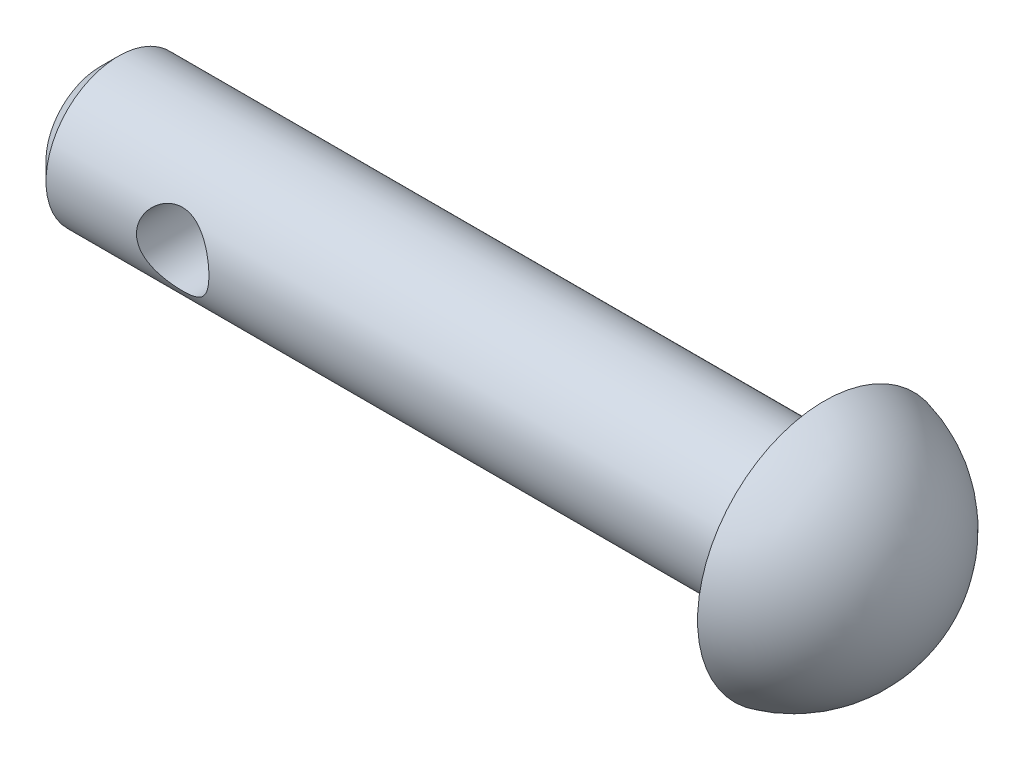
ISO-10303-21;
HEADER;
FILE_DESCRIPTION(('STEP AP214'),'2;1');
FILE_NAME('part.step','',(''),(''),'','','');
FILE_SCHEMA(('AUTOMOTIVE_DESIGN { 1 0 10303 214 1 1 1 1 }'));
ENDSEC;
DATA;
#1=APPLICATION_CONTEXT('core data for automotive mechanical design processes');
#2=APPLICATION_PROTOCOL_DEFINITION('international standard','automotive_design',2000,#1);
#3=PRODUCT_CONTEXT('',#1,'mechanical');
#4=PRODUCT('Part','Part','',(#3));
#5=PRODUCT_RELATED_PRODUCT_CATEGORY('part','',(#4));
#6=PRODUCT_DEFINITION_FORMATION('','',#4);
#7=PRODUCT_DEFINITION_CONTEXT('part definition',#1,'design');
#8=PRODUCT_DEFINITION('design','',#6,#7);
#9=PRODUCT_DEFINITION_SHAPE('','',#8);
#10=(LENGTH_UNIT() NAMED_UNIT(*) SI_UNIT(.MILLI.,.METRE.));
#11=(NAMED_UNIT(*) PLANE_ANGLE_UNIT() SI_UNIT($,.RADIAN.));
#12=(NAMED_UNIT(*) SI_UNIT($,.STERADIAN.) SOLID_ANGLE_UNIT());
#13=UNCERTAINTY_MEASURE_WITH_UNIT(LENGTH_MEASURE(1.E-05),#10,'distance_accuracy_value','');
#14=(GEOMETRIC_REPRESENTATION_CONTEXT(3) GLOBAL_UNCERTAINTY_ASSIGNED_CONTEXT((#13)) GLOBAL_UNIT_ASSIGNED_CONTEXT((#10,
#11,#12)) REPRESENTATION_CONTEXT('',''));
#15=CARTESIAN_POINT('',(0.,0.,0.));
#16=DIRECTION('',(0.,0.,1.));
#17=DIRECTION('',(1.,0.,0.));
#18=AXIS2_PLACEMENT_3D('',#15,#16,#17);
#19=CARTESIAN_POINT('',(-20.,0.,0.));
#20=DIRECTION('',(1.,0.,0.));
#21=DIRECTION('',(0.,0.,-1.));
#22=AXIS2_PLACEMENT_3D('',#19,#20,#21);
#23=CYLINDRICAL_SURFACE('',#22,2.);
#24=CARTESIAN_POINT('',(-19.5,0.,0.));
#25=DIRECTION('',(1.,0.,0.));
#26=DIRECTION('',(0.,0.,-1.));
#27=AXIS2_PLACEMENT_3D('',#24,#25,#26);
#28=CIRCLE('',#27,2.);
#29=CARTESIAN_POINT('',(-19.5,0.,-2.));
#30=VERTEX_POINT('',#29);
#31=EDGE_CURVE('E45',#30,#30,#28,.T.);
#32=ORIENTED_EDGE('',*,*,#31,.T.);
#33=EDGE_LOOP('',(#32));
#34=FACE_BOUND('',#33,.T.);
#35=CARTESIAN_POINT('',(-15.,0.,-2.));
#36=CARTESIAN_POINT('',(-15.0000033023195,-0.0525719629529865,-1.99999713404151));
#37=CARTESIAN_POINT('',(-15.0041700731217,-0.105206599698033,-1.99790491019518));
#38=CARTESIAN_POINT('',(-15.0206528803409,-0.208920235268425,-1.98974156037396));
#39=CARTESIAN_POINT('',(-15.0329843929976,-0.259996086713504,-1.98366287828984));
#40=CARTESIAN_POINT('',(-15.0651938086168,-0.358933544880575,-1.96816279403312));
#41=CARTESIAN_POINT('',(-15.085042384248,-0.406806802939181,-1.9587543917752));
#42=CARTESIAN_POINT('',(-15.1315706213649,-0.498472616806566,-1.93745776515779));
#43=CARTESIAN_POINT('',(-15.1582497442489,-0.54226549399005,-1.9255697363353));
#44=CARTESIAN_POINT('',(-15.2195172494853,-0.62750781776192,-1.89956258258057));
#45=CARTESIAN_POINT('',(-15.2544864792396,-0.668655211122113,-1.88535199127536));
#46=CARTESIAN_POINT('',(-15.330521479247,-0.744779444866978,-1.85659970246744));
#47=CARTESIAN_POINT('',(-15.3715918517724,-0.779751583106767,-1.84205776209035));
#48=CARTESIAN_POINT('',(-15.4624833495234,-0.84525200045028,-1.81298951197347));
#49=CARTESIAN_POINT('',(-15.5127360983459,-0.875225335551638,-1.79855186970132));
#50=CARTESIAN_POINT('',(-15.6183673359862,-0.926168226890696,-1.77285978772321));
#51=CARTESIAN_POINT('',(-15.6737421287227,-0.947144214966335,-1.7616030760699));
#52=CARTESIAN_POINT('',(-15.7846651054219,-0.97813244218859,-1.74457867037808));
#53=CARTESIAN_POINT('',(-15.8400044520674,-0.988725857080443,-1.73852271583713));
#54=CARTESIAN_POINT('',(-15.9519788377795,-1.00042699330885,-1.73181889948528));
#55=CARTESIAN_POINT('',(-16.0086125408712,-1.00154408837308,-1.73116569343288));
#56=CARTESIAN_POINT('',(-16.1142860243154,-0.994687287172296,-1.73510930257248));
#57=CARTESIAN_POINT('',(-16.163424031223,-0.987784559536823,-1.73908763662013));
#58=CARTESIAN_POINT('',(-16.259721909373,-0.966939849056935,-1.7507622873385));
#59=CARTESIAN_POINT('',(-16.3068811453053,-0.952995623897654,-1.75845978831776));
#60=CARTESIAN_POINT('',(-16.3992291325657,-0.918209780386006,-1.77687476412741));
#61=CARTESIAN_POINT('',(-16.4443463987858,-0.897215067115997,-1.78765840663998));
#62=CARTESIAN_POINT('',(-16.53063429259,-0.849041687668004,-1.81103404281404));
#63=CARTESIAN_POINT('',(-16.5718031356001,-0.821860243812469,-1.8236268478019));
#64=CARTESIAN_POINT('',(-16.6545212527432,-0.75806605491279,-1.85113157903286));
#65=CARTESIAN_POINT('',(-16.6954568735762,-0.720694458369283,-1.86613510236746));
#66=CARTESIAN_POINT('',(-16.7707354185909,-0.639555578741374,-1.89547623300407));
#67=CARTESIAN_POINT('',(-16.8050751920339,-0.595785256574287,-1.90981351958801));
#68=CARTESIAN_POINT('',(-16.8676856610297,-0.50051650583185,-1.93701987282964));
#69=CARTESIAN_POINT('',(-16.8956004724457,-0.448753591599411,-1.94978984162007));
#70=CARTESIAN_POINT('',(-16.942097029043,-0.340466215488799,-1.97157881121242));
#71=CARTESIAN_POINT('',(-16.9606861850152,-0.283945576265279,-1.98060078943553));
#72=CARTESIAN_POINT('',(-16.9864754037167,-0.172766491660705,-1.99324333741436));
#73=CARTESIAN_POINT('',(-16.9944912357468,-0.118341530548327,-1.99724938301312));
#74=CARTESIAN_POINT('',(-17.0014647311345,-0.00877959994935651,-2.00073013459102));
#75=CARTESIAN_POINT('',(-17.0004266856395,0.0463570198698988,-2.00020698721312));
#76=CARTESIAN_POINT('',(-16.9897933115812,0.151232971985991,-1.99491192253441));
#77=CARTESIAN_POINT('',(-16.98086746727,0.201059408049952,-1.9904724568819));
#78=CARTESIAN_POINT('',(-16.9557619281049,0.298406892301915,-1.97822171314819));
#79=CARTESIAN_POINT('',(-16.9395814335466,0.345927685690995,-1.97041006334332));
#80=CARTESIAN_POINT('',(-16.9000015335668,0.438888608449664,-1.95184251413669));
#81=CARTESIAN_POINT('',(-16.8764089498832,0.484230397006153,-1.94100881769939));
#82=CARTESIAN_POINT('',(-16.822892464354,0.570461361698921,-1.91743974317109));
#83=CARTESIAN_POINT('',(-16.7929658654066,0.611348629775281,-1.90470355565785));
#84=CARTESIAN_POINT('',(-16.7242395746671,0.691767689290653,-1.87708221337464));
#85=CARTESIAN_POINT('',(-16.6848571315464,0.730772077824639,-1.86210884848441));
#86=CARTESIAN_POINT('',(-16.6000748487307,0.80185632111324,-1.83262391603874));
#87=CARTESIAN_POINT('',(-16.5546708811836,0.833931385690841,-1.81811267381526));
#88=CARTESIAN_POINT('',(-16.4563563457997,0.891707914497694,-1.79051192226068));
#89=CARTESIAN_POINT('',(-16.4031887337914,0.917025495878636,-1.77752529663472));
#90=CARTESIAN_POINT('',(-16.2924899323075,0.958082826013803,-1.75574072368126));
#91=CARTESIAN_POINT('',(-16.2349644734988,0.97383491588757,-1.74693738240618));
#92=CARTESIAN_POINT('',(-16.1230897771386,0.99386168744968,-1.73561501008667));
#93=CARTESIAN_POINT('',(-16.068965746571,0.999092996400866,-1.73257383460491));
#94=CARTESIAN_POINT('',(-15.9605529328293,1.00068915438079,-1.73165354646175));
#95=CARTESIAN_POINT('',(-15.9062642312606,0.997057846624401,-1.73377219627552));
#96=CARTESIAN_POINT('',(-15.804516498468,0.981926125592265,-1.74237862050025));
#97=CARTESIAN_POINT('',(-15.7568995298556,0.971208314342801,-1.74843094482394));
#98=CARTESIAN_POINT('',(-15.6641918805753,0.943175358224647,-1.76371016187917));
#99=CARTESIAN_POINT('',(-15.619102017908,0.925858091159812,-1.77293807569675));
#100=CARTESIAN_POINT('',(-15.5293751490134,0.883815745300685,-1.79428530364528));
#101=CARTESIAN_POINT('',(-15.4849720981703,0.85867113781646,-1.8065572239619));
#102=CARTESIAN_POINT('',(-15.4007254638194,0.802150971636636,-1.8323533163459));
#103=CARTESIAN_POINT('',(-15.3608842694815,0.77077217123865,-1.84587813794522));
#104=CARTESIAN_POINT('',(-15.2818580176424,0.698203326664643,-1.87462323159313));
#105=CARTESIAN_POINT('',(-15.2433408976381,0.656284423010173,-1.88984983311469));
#106=CARTESIAN_POINT('',(-15.1737370165764,0.566154806220281,-1.91877752255088));
#107=CARTESIAN_POINT('',(-15.1426542605737,0.517940723256786,-1.9324777860804));
#108=CARTESIAN_POINT('',(-15.0887636372378,0.415931596819949,-1.95698009585103));
#109=CARTESIAN_POINT('',(-15.0660158305886,0.362099503934616,-1.96776096562909));
#110=CARTESIAN_POINT('',(-15.030191832081,0.250742101294193,-1.98501341363465));
#111=CARTESIAN_POINT('',(-15.0170881531704,0.193227799623168,-1.99149723372932));
#112=CARTESIAN_POINT('',(-15.0061025889241,0.112601946483386,-1.99695461909663));
#113=CARTESIAN_POINT('',(-15.0038173591364,0.0901618794395003,-1.99809365339202));
#114=CARTESIAN_POINT('',(-15.0007653344832,0.0451517318071585,-1.99961696977865));
#115=CARTESIAN_POINT('',(-14.9999985815288,0.0225816476473818,-2.00000123103763));
#116=CARTESIAN_POINT('',(-15.,0.,-2.));
#117=B_SPLINE_CURVE_WITH_KNOTS('',3,(#35,#36,#37,#38,#39,#40,#41,#42,#43,#44,#45,#46,#47,#48,
#49,#50,#51,#52,#53,#54,#55,#56,#57,#58,#59,#60,#61,#62,#63,#64,#65,#66,#67,#68,#69,#70,#71,#72,
#73,#74,#75,#76,#77,#78,#79,#80,#81,#82,#83,#84,#85,#86,#87,#88,#89,#90,#91,#92,#93,#94,#95,#96,
#97,#98,#99,#100,#101,#102,#103,#104,#105,#106,#107,#108,#109,#110,#111,#112,#113,#114,#115,
#116),.UNSPECIFIED.,.T.,.F.,(4,2,2,2,2,2,2,2,2,2,2,2,2,2,2,2,2,2,2,2,2,2,2,2,2,2,2,2,2,2,2,2,2,
2,2,2,2,2,2,2,4),(0.,0.157624257420293,0.315548149709198,0.472862155492299,0.630163760581568,
0.79698175871809,0.963926237654036,1.14381726430753,1.32357947898281,1.4925801214023,
1.6614135732902,1.8100571240932,1.95874803925678,2.11090240168487,2.26312521260222,
2.43464941333879,2.60625534598687,2.78583022214441,2.9652621691228,3.12983290471346,
3.29432564511476,3.44606906506122,3.59782921630932,3.75392856027899,3.9100945074834,
4.08159610644419,4.25321588615432,4.43314682159674,4.61284511940778,4.77529307498374,
4.93767059860006,5.08457930244183,5.23153528783678,5.38836456775615,5.54527561138958,
5.72125242752499,5.89732383376573,6.07464013662926,6.25144908624931,6.31915280137698,
6.38685838514848),.UNSPECIFIED.);
#118=CARTESIAN_POINT('',(-15.,0.,-2.));
#119=VERTEX_POINT('',#118);
#120=EDGE_CURVE('E50',#119,#119,#117,.T.);
#121=ORIENTED_EDGE('',*,*,#120,.F.);
#122=EDGE_LOOP('',(#121));
#123=FACE_BOUND('',#122,.T.);
#124=CARTESIAN_POINT('',(-15.,0.,2.));
#125=CARTESIAN_POINT('',(-15.0000033023195,0.0525719629529865,1.99999713404151));
#126=CARTESIAN_POINT('',(-15.0041700731217,0.105206599698033,1.99790491019518));
#127=CARTESIAN_POINT('',(-15.0206528803409,0.208920235268425,1.98974156037396));
#128=CARTESIAN_POINT('',(-15.0329843929976,0.259996086713504,1.98366287828984));
#129=CARTESIAN_POINT('',(-15.0651938086168,0.358933544880575,1.96816279403312));
#130=CARTESIAN_POINT('',(-15.085042384248,0.406806802939181,1.9587543917752));
#131=CARTESIAN_POINT('',(-15.1315706213649,0.498472616806566,1.93745776515779));
#132=CARTESIAN_POINT('',(-15.1582497442489,0.54226549399005,1.9255697363353));
#133=CARTESIAN_POINT('',(-15.2195172494853,0.62750781776192,1.89956258258057));
#134=CARTESIAN_POINT('',(-15.2544864792396,0.668655211122113,1.88535199127536));
#135=CARTESIAN_POINT('',(-15.330521479247,0.744779444866978,1.85659970246744));
#136=CARTESIAN_POINT('',(-15.3715918517724,0.779751583106767,1.84205776209035));
#137=CARTESIAN_POINT('',(-15.4624833495234,0.84525200045028,1.81298951197347));
#138=CARTESIAN_POINT('',(-15.5127360983459,0.875225335551638,1.79855186970132));
#139=CARTESIAN_POINT('',(-15.6183673359862,0.926168226890696,1.77285978772321));
#140=CARTESIAN_POINT('',(-15.6737421287227,0.947144214966335,1.7616030760699));
#141=CARTESIAN_POINT('',(-15.7846651054219,0.97813244218859,1.74457867037808));
#142=CARTESIAN_POINT('',(-15.8400044520674,0.988725857080443,1.73852271583713));
#143=CARTESIAN_POINT('',(-15.9519788377795,1.00042699330885,1.73181889948528));
#144=CARTESIAN_POINT('',(-16.0086125408712,1.00154408837308,1.73116569343288));
#145=CARTESIAN_POINT('',(-16.1142860243154,0.994687287172296,1.73510930257248));
#146=CARTESIAN_POINT('',(-16.163424031223,0.987784559536823,1.73908763662013));
#147=CARTESIAN_POINT('',(-16.259721909373,0.966939849056935,1.7507622873385));
#148=CARTESIAN_POINT('',(-16.3068811453053,0.952995623897654,1.75845978831776));
#149=CARTESIAN_POINT('',(-16.3992291325657,0.918209780386006,1.77687476412741));
#150=CARTESIAN_POINT('',(-16.4443463987858,0.897215067115997,1.78765840663998));
#151=CARTESIAN_POINT('',(-16.53063429259,0.849041687668004,1.81103404281404));
#152=CARTESIAN_POINT('',(-16.5718031356001,0.821860243812469,1.8236268478019));
#153=CARTESIAN_POINT('',(-16.6545212527432,0.75806605491279,1.85113157903286));
#154=CARTESIAN_POINT('',(-16.6954568735762,0.720694458369283,1.86613510236746));
#155=CARTESIAN_POINT('',(-16.7707354185909,0.639555578741374,1.89547623300407));
#156=CARTESIAN_POINT('',(-16.8050751920339,0.595785256574287,1.90981351958801));
#157=CARTESIAN_POINT('',(-16.8676856610297,0.50051650583185,1.93701987282964));
#158=CARTESIAN_POINT('',(-16.8956004724457,0.448753591599411,1.94978984162007));
#159=CARTESIAN_POINT('',(-16.942097029043,0.340466215488799,1.97157881121242));
#160=CARTESIAN_POINT('',(-16.9606861850152,0.283945576265279,1.98060078943553));
#161=CARTESIAN_POINT('',(-16.9864754037167,0.172766491660705,1.99324333741436));
#162=CARTESIAN_POINT('',(-16.9944912357468,0.118341530548327,1.99724938301312));
#163=CARTESIAN_POINT('',(-17.0014647311345,0.00877959994935651,2.00073013459102));
#164=CARTESIAN_POINT('',(-17.0004266856395,-0.0463570198698988,2.00020698721312));
#165=CARTESIAN_POINT('',(-16.9897933115812,-0.151232971985991,1.99491192253441));
#166=CARTESIAN_POINT('',(-16.98086746727,-0.201059408049952,1.9904724568819));
#167=CARTESIAN_POINT('',(-16.9557619281049,-0.298406892301915,1.97822171314819));
#168=CARTESIAN_POINT('',(-16.9395814335466,-0.345927685690995,1.97041006334332));
#169=CARTESIAN_POINT('',(-16.9000015335668,-0.438888608449664,1.95184251413669));
#170=CARTESIAN_POINT('',(-16.8764089498832,-0.484230397006153,1.94100881769939));
#171=CARTESIAN_POINT('',(-16.822892464354,-0.570461361698921,1.91743974317109));
#172=CARTESIAN_POINT('',(-16.7929658654066,-0.611348629775281,1.90470355565785));
#173=CARTESIAN_POINT('',(-16.7242395746671,-0.691767689290653,1.87708221337464));
#174=CARTESIAN_POINT('',(-16.6848571315464,-0.730772077824639,1.86210884848441));
#175=CARTESIAN_POINT('',(-16.6000748487307,-0.80185632111324,1.83262391603874));
#176=CARTESIAN_POINT('',(-16.5546708811836,-0.833931385690841,1.81811267381526));
#177=CARTESIAN_POINT('',(-16.4563563457997,-0.891707914497694,1.79051192226068));
#178=CARTESIAN_POINT('',(-16.4031887337914,-0.917025495878636,1.77752529663472));
#179=CARTESIAN_POINT('',(-16.2924899323075,-0.958082826013803,1.75574072368126));
#180=CARTESIAN_POINT('',(-16.2349644734988,-0.97383491588757,1.74693738240618));
#181=CARTESIAN_POINT('',(-16.1230897771386,-0.99386168744968,1.73561501008667));
#182=CARTESIAN_POINT('',(-16.068965746571,-0.999092996400866,1.73257383460491));
#183=CARTESIAN_POINT('',(-15.9605529328293,-1.00068915438079,1.73165354646175));
#184=CARTESIAN_POINT('',(-15.9062642312606,-0.997057846624401,1.73377219627552));
#185=CARTESIAN_POINT('',(-15.804516498468,-0.981926125592265,1.74237862050025));
#186=CARTESIAN_POINT('',(-15.7568995298556,-0.971208314342801,1.74843094482394));
#187=CARTESIAN_POINT('',(-15.6641918805753,-0.943175358224647,1.76371016187917));
#188=CARTESIAN_POINT('',(-15.619102017908,-0.925858091159812,1.77293807569675));
#189=CARTESIAN_POINT('',(-15.5293751490134,-0.883815745300685,1.79428530364528));
#190=CARTESIAN_POINT('',(-15.4849720981703,-0.85867113781646,1.8065572239619));
#191=CARTESIAN_POINT('',(-15.4007254638194,-0.802150971636636,1.8323533163459));
#192=CARTESIAN_POINT('',(-15.3608842694815,-0.77077217123865,1.84587813794522));
#193=CARTESIAN_POINT('',(-15.2818580176424,-0.698203326664643,1.87462323159313));
#194=CARTESIAN_POINT('',(-15.2433408976381,-0.656284423010173,1.88984983311469));
#195=CARTESIAN_POINT('',(-15.1737370165764,-0.566154806220281,1.91877752255088));
#196=CARTESIAN_POINT('',(-15.1426542605737,-0.517940723256786,1.9324777860804));
#197=CARTESIAN_POINT('',(-15.0887636372378,-0.415931596819949,1.95698009585103));
#198=CARTESIAN_POINT('',(-15.0660158305886,-0.362099503934616,1.96776096562909));
#199=CARTESIAN_POINT('',(-15.030191832081,-0.250742101294193,1.98501341363465));
#200=CARTESIAN_POINT('',(-15.0170881531704,-0.193227799623168,1.99149723372932));
#201=CARTESIAN_POINT('',(-15.0061025889241,-0.112601946483386,1.99695461909663));
#202=CARTESIAN_POINT('',(-15.0038173591364,-0.0901618794395003,1.99809365339202));
#203=CARTESIAN_POINT('',(-15.0007653344832,-0.0451517318071585,1.99961696977865));
#204=CARTESIAN_POINT('',(-14.9999985815288,-0.0225816476473818,2.00000123103763));
#205=CARTESIAN_POINT('',(-15.,0.,2.));
#206=B_SPLINE_CURVE_WITH_KNOTS('',3,(#124,#125,#126,#127,#128,#129,#130,#131,#132,#133,#134,
#135,#136,#137,#138,#139,#140,#141,#142,#143,#144,#145,#146,#147,#148,#149,#150,#151,#152,#153,
#154,#155,#156,#157,#158,#159,#160,#161,#162,#163,#164,#165,#166,#167,#168,#169,#170,#171,#172,
#173,#174,#175,#176,#177,#178,#179,#180,#181,#182,#183,#184,#185,#186,#187,#188,#189,#190,#191,
#192,#193,#194,#195,#196,#197,#198,#199,#200,#201,#202,#203,#204,#205),.UNSPECIFIED.,.T.,.F.,(4,
2,2,2,2,2,2,2,2,2,2,2,2,2,2,2,2,2,2,2,2,2,2,2,2,2,2,2,2,2,2,2,2,2,2,2,2,2,2,2,4),(0.,
0.157624257420293,0.315548149709198,0.472862155492299,0.630163760581568,0.79698175871809,
0.963926237654036,1.14381726430753,1.32357947898281,1.4925801214023,1.6614135732902,
1.8100571240932,1.95874803925678,2.11090240168487,2.26312521260222,2.43464941333879,
2.60625534598687,2.78583022214441,2.9652621691228,3.12983290471346,3.29432564511476,
3.44606906506122,3.59782921630932,3.75392856027899,3.9100945074834,4.08159610644419,
4.25321588615432,4.43314682159674,4.61284511940778,4.77529307498374,4.93767059860006,
5.08457930244183,5.23153528783678,5.38836456775615,5.54527561138958,5.72125242752499,
5.89732383376573,6.07464013662926,6.25144908624931,6.31915280137698,6.38685838514848),.UNSPECIFIED.);
#207=CARTESIAN_POINT('',(-15.,0.,2.));
#208=VERTEX_POINT('',#207);
#209=EDGE_CURVE('E55',#208,#208,#206,.T.);
#210=ORIENTED_EDGE('',*,*,#209,.F.);
#211=EDGE_LOOP('',(#210));
#212=FACE_BOUND('',#211,.T.);
#213=CARTESIAN_POINT('',(0.,0.,0.));
#214=DIRECTION('',(1.,0.,0.));
#215=DIRECTION('',(0.,0.,-1.));
#216=AXIS2_PLACEMENT_3D('',#213,#214,#215);
#217=CIRCLE('',#216,2.);
#218=CARTESIAN_POINT('',(0.,0.,-2.));
#219=VERTEX_POINT('',#218);
#220=EDGE_CURVE('E91',#219,#219,#217,.T.);
#221=ORIENTED_EDGE('',*,*,#220,.F.);
#222=EDGE_LOOP('',(#221));
#223=FACE_BOUND('',#222,.T.);
#224=ADVANCED_FACE('F37',(#34,#123,#212,#223),#23,.T.);
#225=CARTESIAN_POINT('',(-20.,0.,0.));
#226=DIRECTION('',(1.,0.,0.));
#227=DIRECTION('',(0.,0.,-1.));
#228=AXIS2_PLACEMENT_3D('',#225,#226,#227);
#229=PLANE('',#228);
#230=CARTESIAN_POINT('',(-20.,0.,0.));
#231=DIRECTION('',(1.,0.,0.));
#232=DIRECTION('',(0.,0.,-1.));
#233=AXIS2_PLACEMENT_3D('',#230,#231,#232);
#234=CIRCLE('',#233,1.49999999999999);
#235=CARTESIAN_POINT('',(-20.,0.,-1.49999999999999));
#236=VERTEX_POINT('',#235);
#237=EDGE_CURVE('E10',#236,#236,#234,.F.);
#238=ORIENTED_EDGE('',*,*,#237,.T.);
#239=EDGE_LOOP('',(#238));
#240=FACE_BOUND('',#239,.T.);
#241=ADVANCED_FACE('F72',(#240),#229,.F.);
#242=CARTESIAN_POINT('',(-16.,0.,-2.));
#243=DIRECTION('',(0.,0.,1.));
#244=DIRECTION('',(1.,0.,0.));
#245=AXIS2_PLACEMENT_3D('',#242,#243,#244);
#246=CYLINDRICAL_SURFACE('',#245,1.);
#247=ORIENTED_EDGE('',*,*,#120,.T.);
#248=EDGE_LOOP('',(#247));
#249=FACE_BOUND('',#248,.T.);
#250=ORIENTED_EDGE('',*,*,#209,.T.);
#251=EDGE_LOOP('',(#250));
#252=FACE_BOUND('',#251,.T.);
#253=ADVANCED_FACE('F68',(#249,#252),#246,.F.);
#254=CARTESIAN_POINT('',(-19.5,0.,0.));
#255=DIRECTION('',(1.,0.,0.));
#256=DIRECTION('',(0.,0.,-1.));
#257=AXIS2_PLACEMENT_3D('',#254,#255,#256);
#258=CONICAL_SURFACE('',#257,2.,0.785398163397452);
#259=ORIENTED_EDGE('',*,*,#237,.F.);
#260=EDGE_LOOP('',(#259));
#261=FACE_BOUND('',#260,.T.);
#262=ORIENTED_EDGE('',*,*,#31,.F.);
#263=EDGE_LOOP('',(#262));
#264=FACE_BOUND('',#263,.T.);
#265=ADVANCED_FACE('F39',(#261,#264),#258,.T.);
#266=CARTESIAN_POINT('',(-0.842614977317633,0.,0.));
#267=DIRECTION('',(1.,0.,0.));
#268=DIRECTION('',(0.,0.,-1.));
#269=AXIS2_PLACEMENT_3D('',#266,#267,#268);
#270=SPHERICAL_SURFACE('',#269,3.6);
#271=CARTESIAN_POINT('',(0.,0.,0.));
#272=DIRECTION('',(1.,0.,0.));
#273=DIRECTION('',(0.,0.,-1.));
#274=AXIS2_PLACEMENT_3D('',#271,#272,#273);
#275=CIRCLE('',#274,3.5);
#276=CARTESIAN_POINT('',(0.,0.,-3.5));
#277=VERTEX_POINT('',#276);
#278=EDGE_CURVE('E94',#277,#277,#275,.T.);
#279=ORIENTED_EDGE('',*,*,#278,.T.);
#280=EDGE_LOOP('',(#279));
#281=FACE_BOUND('',#280,.T.);
#282=ADVANCED_FACE('F74',(#281),#270,.T.);
#283=CARTESIAN_POINT('',(0.,0.,0.));
#284=DIRECTION('',(-1.,0.,0.));
#285=DIRECTION('',(0.,0.,1.));
#286=AXIS2_PLACEMENT_3D('',#283,#284,#285);
#287=PLANE('',#286);
#288=ORIENTED_EDGE('',*,*,#220,.T.);
#289=EDGE_LOOP('',(#288));
#290=FACE_BOUND('',#289,.T.);
#291=ORIENTED_EDGE('',*,*,#278,.F.);
#292=EDGE_LOOP('',(#291));
#293=FACE_BOUND('',#292,.T.);
#294=ADVANCED_FACE('F102',(#290,#293),#287,.T.);
#295=CLOSED_SHELL('',(#224,#241,#253,#265,#282,#294));
#296=MANIFOLD_SOLID_BREP('B2',#295);
#297=ADVANCED_BREP_SHAPE_REPRESENTATION('',(#18,#296),#14);
#298=SHAPE_DEFINITION_REPRESENTATION(#9,#297);
ENDSEC;
END-ISO-10303-21;
